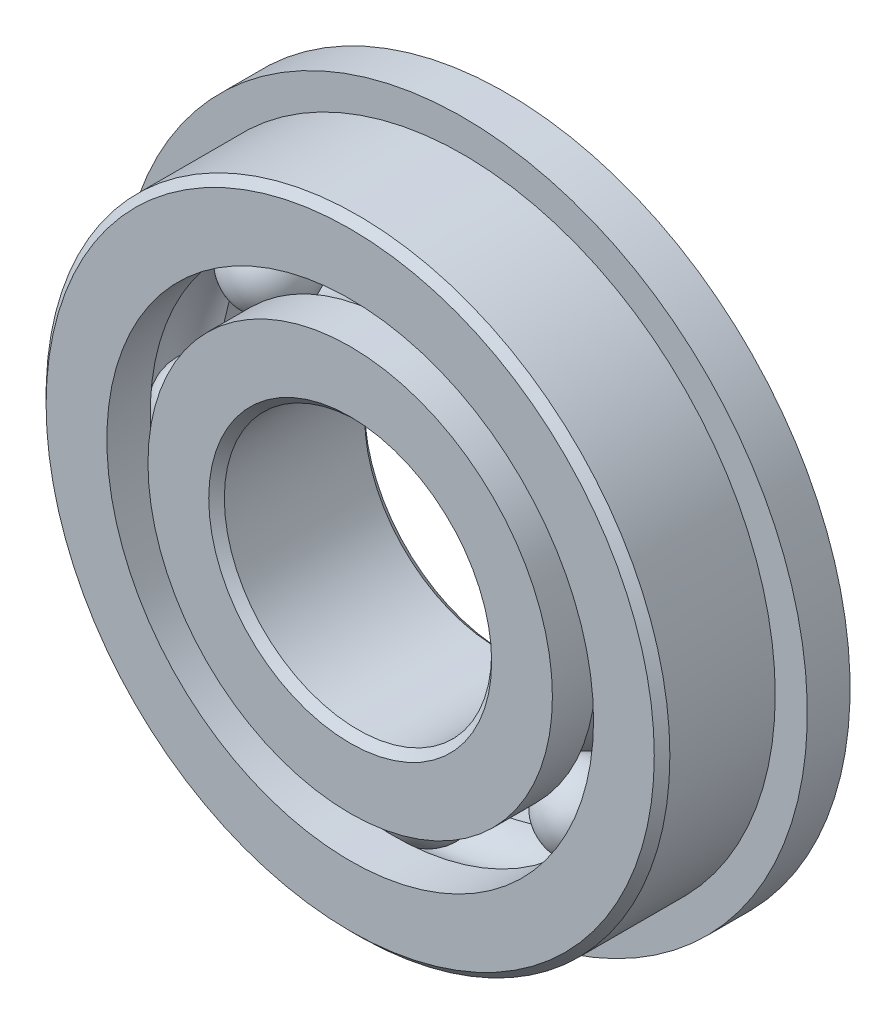
ISO-10303-21;
HEADER;
FILE_DESCRIPTION(('STEP AP214'),'2;1');
FILE_NAME('part.step','',(''),(''),'','','');
FILE_SCHEMA(('AUTOMOTIVE_DESIGN { 1 0 10303 214 1 1 1 1 }'));
ENDSEC;
DATA;
#1=APPLICATION_CONTEXT('core data for automotive mechanical design processes');
#2=APPLICATION_PROTOCOL_DEFINITION('international standard','automotive_design',2000,#1);
#3=PRODUCT_CONTEXT('',#1,'mechanical');
#4=PRODUCT('Part','Part','',(#3));
#5=PRODUCT_RELATED_PRODUCT_CATEGORY('part','',(#4));
#6=PRODUCT_DEFINITION_FORMATION('','',#4);
#7=PRODUCT_DEFINITION_CONTEXT('part definition',#1,'design');
#8=PRODUCT_DEFINITION('design','',#6,#7);
#9=PRODUCT_DEFINITION_SHAPE('','',#8);
#10=(LENGTH_UNIT() NAMED_UNIT(*) SI_UNIT(.MILLI.,.METRE.));
#11=(NAMED_UNIT(*) PLANE_ANGLE_UNIT() SI_UNIT($,.RADIAN.));
#12=(NAMED_UNIT(*) SI_UNIT($,.STERADIAN.) SOLID_ANGLE_UNIT());
#13=UNCERTAINTY_MEASURE_WITH_UNIT(LENGTH_MEASURE(1.E-05),#10,'distance_accuracy_value','');
#14=(GEOMETRIC_REPRESENTATION_CONTEXT(3) GLOBAL_UNCERTAINTY_ASSIGNED_CONTEXT((#13)) GLOBAL_UNIT_ASSIGNED_CONTEXT((#10,
#11,#12)) REPRESENTATION_CONTEXT('',''));
#15=CARTESIAN_POINT('',(0.,0.,0.));
#16=DIRECTION('',(0.,0.,1.));
#17=DIRECTION('',(1.,0.,0.));
#18=AXIS2_PLACEMENT_3D('',#15,#16,#17);
#19=CARTESIAN_POINT('',(-5.61266007566815,5.61266007566829,0.));
#20=DIRECTION('',(0.,0.,1.));
#21=DIRECTION('',(-0.707106781186539,0.707106781186556,0.));
#22=AXIS2_PLACEMENT_3D('',#19,#20,#21);
#23=SPHERICAL_SURFACE('',#22,1.43574962434293);
#24=CARTESIAN_POINT('',(-5.61266007566815,5.61266007566829,1.43574962434293));
#25=VERTEX_POINT('',#24);
#26=VERTEX_LOOP('',#25);
#27=FACE_BOUND('',#26,.T.);
#28=ADVANCED_FACE('F48',(#27),#23,.T.);
#29=CLOSED_SHELL('',(#28));
#30=MANIFOLD_SOLID_BREP('B2',#29);
#31=CARTESIAN_POINT('',(-7.9375,0.,0.));
#32=DIRECTION('',(0.,0.,1.));
#33=DIRECTION('',(-1.,0.,0.));
#34=AXIS2_PLACEMENT_3D('',#31,#32,#33);
#35=SPHERICAL_SURFACE('',#34,1.43574962434293);
#36=CARTESIAN_POINT('',(-7.9375,0.,1.43574962434293));
#37=VERTEX_POINT('',#36);
#38=VERTEX_LOOP('',#37);
#39=FACE_BOUND('',#38,.T.);
#40=ADVANCED_FACE('F69',(#39),#35,.T.);
#41=CLOSED_SHELL('',(#40));
#42=MANIFOLD_SOLID_BREP('B6',#41);
#43=CARTESIAN_POINT('',(-5.61266007566827,-5.61266007566817,0.));
#44=DIRECTION('',(0.,0.,1.));
#45=DIRECTION('',(-0.707106781186554,-0.707106781186541,0.));
#46=AXIS2_PLACEMENT_3D('',#43,#44,#45);
#47=SPHERICAL_SURFACE('',#46,1.43574962434293);
#48=CARTESIAN_POINT('',(-5.61266007566827,-5.61266007566817,1.43574962434293));
#49=VERTEX_POINT('',#48);
#50=VERTEX_LOOP('',#49);
#51=FACE_BOUND('',#50,.T.);
#52=ADVANCED_FACE('F90',(#51),#47,.T.);
#53=CLOSED_SHELL('',(#52));
#54=MANIFOLD_SOLID_BREP('B44',#53);
#55=CARTESIAN_POINT('',(0.,-7.9375,0.));
#56=DIRECTION('',(0.,0.,1.));
#57=DIRECTION('',(0.,-1.,0.));
#58=AXIS2_PLACEMENT_3D('',#55,#56,#57);
#59=SPHERICAL_SURFACE('',#58,1.43574962434293);
#60=CARTESIAN_POINT('',(0.,-7.9375,1.43574962434293));
#61=VERTEX_POINT('',#60);
#62=VERTEX_LOOP('',#61);
#63=FACE_BOUND('',#62,.T.);
#64=ADVANCED_FACE('F111',(#63),#59,.T.);
#65=CLOSED_SHELL('',(#64));
#66=MANIFOLD_SOLID_BREP('B65',#65);
#67=CARTESIAN_POINT('',(5.61266007566819,-5.61266007566825,0.));
#68=DIRECTION('',(0.,0.,1.));
#69=DIRECTION('',(0.707106781186544,-0.707106781186551,0.));
#70=AXIS2_PLACEMENT_3D('',#67,#68,#69);
#71=SPHERICAL_SURFACE('',#70,1.43574962434293);
#72=CARTESIAN_POINT('',(5.61266007566819,-5.61266007566825,1.43574962434293));
#73=VERTEX_POINT('',#72);
#74=VERTEX_LOOP('',#73);
#75=FACE_BOUND('',#74,.T.);
#76=ADVANCED_FACE('F132',(#75),#71,.T.);
#77=CLOSED_SHELL('',(#76));
#78=MANIFOLD_SOLID_BREP('B86',#77);
#79=CARTESIAN_POINT('',(7.9375,0.,0.));
#80=DIRECTION('',(0.,0.,1.));
#81=DIRECTION('',(1.,0.,0.));
#82=AXIS2_PLACEMENT_3D('',#79,#80,#81);
#83=SPHERICAL_SURFACE('',#82,1.43574962434293);
#84=CARTESIAN_POINT('',(7.9375,0.,1.43574962434293));
#85=VERTEX_POINT('',#84);
#86=VERTEX_LOOP('',#85);
#87=FACE_BOUND('',#86,.T.);
#88=ADVANCED_FACE('F153',(#87),#83,.T.);
#89=CLOSED_SHELL('',(#88));
#90=MANIFOLD_SOLID_BREP('B107',#89);
#91=CARTESIAN_POINT('',(5.61266007566823,5.61266007566821,0.));
#92=DIRECTION('',(0.,0.,1.));
#93=DIRECTION('',(0.707106781186549,0.707106781186546,0.));
#94=AXIS2_PLACEMENT_3D('',#91,#92,#93);
#95=SPHERICAL_SURFACE('',#94,1.43574962434293);
#96=CARTESIAN_POINT('',(5.61266007566823,5.61266007566821,1.43574962434293));
#97=VERTEX_POINT('',#96);
#98=VERTEX_LOOP('',#97);
#99=FACE_BOUND('',#98,.T.);
#100=ADVANCED_FACE('F174',(#99),#95,.T.);
#101=CLOSED_SHELL('',(#100));
#102=MANIFOLD_SOLID_BREP('B128',#101);
#103=CARTESIAN_POINT('',(0.,7.9375,0.));
#104=DIRECTION('',(0.,0.,1.));
#105=DIRECTION('',(0.,1.,0.));
#106=AXIS2_PLACEMENT_3D('',#103,#104,#105);
#107=SPHERICAL_SURFACE('',#106,1.43574962434293);
#108=CARTESIAN_POINT('',(0.,7.9375,1.43574962434293));
#109=VERTEX_POINT('',#108);
#110=VERTEX_LOOP('',#109);
#111=FACE_BOUND('',#110,.T.);
#112=ADVANCED_FACE('F197',(#111),#107,.T.);
#113=CLOSED_SHELL('',(#112));
#114=MANIFOLD_SOLID_BREP('B149',#113);
#115=CARTESIAN_POINT('',(0.,7.20480769230769,2.778125));
#116=DIRECTION('',(0.,0.,-1.));
#117=DIRECTION('',(-1.,0.,0.));
#118=AXIS2_PLACEMENT_3D('',#115,#116,#117);
#119=PLANE('',#118);
#120=CARTESIAN_POINT('',(0.,0.,2.778125));
#121=DIRECTION('',(0.,0.,1.));
#122=DIRECTION('',(1.,0.,0.));
#123=AXIS2_PLACEMENT_3D('',#120,#121,#122);
#124=CIRCLE('',#123,5.0403125);
#125=CARTESIAN_POINT('',(5.0403125,0.,2.778125));
#126=VERTEX_POINT('',#125);
#127=EDGE_CURVE('E254',#126,#126,#124,.T.);
#128=ORIENTED_EDGE('',*,*,#127,.F.);
#129=EDGE_LOOP('',(#128));
#130=FACE_BOUND('',#129,.T.);
#131=CARTESIAN_POINT('',(0.,0.,2.778125));
#132=DIRECTION('',(0.,0.,1.));
#133=DIRECTION('',(1.,0.,0.));
#134=AXIS2_PLACEMENT_3D('',#131,#132,#133);
#135=CIRCLE('',#134,7.20480769230769);
#136=CARTESIAN_POINT('',(7.20480769230769,0.,2.778125));
#137=VERTEX_POINT('',#136);
#138=EDGE_CURVE('E196',#137,#137,#135,.T.);
#139=ORIENTED_EDGE('',*,*,#138,.T.);
#140=EDGE_LOOP('',(#139));
#141=FACE_BOUND('',#140,.T.);
#142=ADVANCED_FACE('F217',(#130,#141),#119,.F.);
#143=CARTESIAN_POINT('',(0.,0.,2.778125));
#144=DIRECTION('',(0.,0.,1.));
#145=DIRECTION('',(1.,0.,0.));
#146=AXIS2_PLACEMENT_3D('',#143,#144,#145);
#147=CYLINDRICAL_SURFACE('',#146,7.20480769230769);
#148=ORIENTED_EDGE('',*,*,#138,.F.);
#149=EDGE_LOOP('',(#148));
#150=FACE_BOUND('',#149,.T.);
#151=CARTESIAN_POINT('',(0.,0.,1.23472222222222));
#152=DIRECTION('',(0.,0.,1.));
#153=DIRECTION('',(1.,0.,0.));
#154=AXIS2_PLACEMENT_3D('',#151,#152,#153);
#155=CIRCLE('',#154,7.20480769230769);
#156=CARTESIAN_POINT('',(7.20480769230769,0.,1.23472222222222));
#157=VERTEX_POINT('',#156);
#158=EDGE_CURVE('E224',#157,#157,#155,.T.);
#159=ORIENTED_EDGE('',*,*,#158,.T.);
#160=EDGE_LOOP('',(#159));
#161=FACE_BOUND('',#160,.T.);
#162=ADVANCED_FACE('F263',(#150,#161),#147,.T.);
#163=CARTESIAN_POINT('',(0.,0.,0.));
#164=DIRECTION('',(0.,0.,1.));
#165=DIRECTION('',(1.,0.,0.));
#166=AXIS2_PLACEMENT_3D('',#163,#164,#165);
#167=TOROIDAL_SURFACE('',#166,7.93749999999999,1.43574962434293);
#168=ORIENTED_EDGE('',*,*,#158,.F.);
#169=EDGE_LOOP('',(#168));
#170=FACE_BOUND('',#169,.T.);
#171=CARTESIAN_POINT('',(0.,0.,-1.23472222222222));
#172=DIRECTION('',(0.,0.,1.));
#173=DIRECTION('',(1.,0.,0.));
#174=AXIS2_PLACEMENT_3D('',#171,#172,#173);
#175=CIRCLE('',#174,7.20480769230769);
#176=CARTESIAN_POINT('',(7.20480769230769,0.,-1.23472222222222));
#177=VERTEX_POINT('',#176);
#178=EDGE_CURVE('E230',#177,#177,#175,.T.);
#179=ORIENTED_EDGE('',*,*,#178,.T.);
#180=EDGE_LOOP('',(#179));
#181=FACE_BOUND('',#180,.T.);
#182=ADVANCED_FACE('F267',(#170,#181),#167,.F.);
#183=CARTESIAN_POINT('',(0.,0.,2.778125));
#184=DIRECTION('',(0.,0.,1.));
#185=DIRECTION('',(1.,0.,0.));
#186=AXIS2_PLACEMENT_3D('',#183,#184,#185);
#187=CYLINDRICAL_SURFACE('',#186,7.20480769230769);
#188=ORIENTED_EDGE('',*,*,#178,.F.);
#189=EDGE_LOOP('',(#188));
#190=FACE_BOUND('',#189,.T.);
#191=CARTESIAN_POINT('',(0.,0.,-2.778125));
#192=DIRECTION('',(0.,0.,1.));
#193=DIRECTION('',(1.,0.,0.));
#194=AXIS2_PLACEMENT_3D('',#191,#192,#193);
#195=CIRCLE('',#194,7.20480769230769);
#196=CARTESIAN_POINT('',(7.20480769230769,0.,-2.778125));
#197=VERTEX_POINT('',#196);
#198=EDGE_CURVE('E236',#197,#197,#195,.T.);
#199=ORIENTED_EDGE('',*,*,#198,.T.);
#200=EDGE_LOOP('',(#199));
#201=FACE_BOUND('',#200,.T.);
#202=ADVANCED_FACE('F272',(#190,#201),#187,.T.);
#203=CARTESIAN_POINT('',(0.,5.0403125,-2.778125));
#204=DIRECTION('',(0.,0.,1.));
#205=DIRECTION('',(1.,0.,0.));
#206=AXIS2_PLACEMENT_3D('',#203,#204,#205);
#207=PLANE('',#206);
#208=ORIENTED_EDGE('',*,*,#198,.F.);
#209=EDGE_LOOP('',(#208));
#210=FACE_BOUND('',#209,.T.);
#211=CARTESIAN_POINT('',(0.,0.,-2.778125));
#212=DIRECTION('',(0.,0.,1.));
#213=DIRECTION('',(1.,0.,0.));
#214=AXIS2_PLACEMENT_3D('',#211,#212,#213);
#215=CIRCLE('',#214,5.0403125);
#216=CARTESIAN_POINT('',(5.0403125,0.,-2.778125));
#217=VERTEX_POINT('',#216);
#218=EDGE_CURVE('E242',#217,#217,#215,.T.);
#219=ORIENTED_EDGE('',*,*,#218,.T.);
#220=EDGE_LOOP('',(#219));
#221=FACE_BOUND('',#220,.T.);
#222=ADVANCED_FACE('F278',(#210,#221),#207,.F.);
#223=CARTESIAN_POINT('',(0.,0.,-2.5003125));
#224=DIRECTION('',(0.,0.,-1.));
#225=DIRECTION('',(-1.,0.,0.));
#226=AXIS2_PLACEMENT_3D('',#223,#224,#225);
#227=CONICAL_SURFACE('',#226,4.7625,0.785398163397442);
#228=ORIENTED_EDGE('',*,*,#218,.F.);
#229=EDGE_LOOP('',(#228));
#230=FACE_BOUND('',#229,.T.);
#231=CARTESIAN_POINT('',(0.,0.,-2.5003125));
#232=DIRECTION('',(0.,0.,1.));
#233=DIRECTION('',(1.,0.,0.));
#234=AXIS2_PLACEMENT_3D('',#231,#232,#233);
#235=CIRCLE('',#234,4.7625);
#236=CARTESIAN_POINT('',(4.7625,0.,-2.5003125));
#237=VERTEX_POINT('',#236);
#238=EDGE_CURVE('E246',#237,#237,#235,.T.);
#239=ORIENTED_EDGE('',*,*,#238,.T.);
#240=EDGE_LOOP('',(#239));
#241=FACE_BOUND('',#240,.T.);
#242=ADVANCED_FACE('F282',(#230,#241),#227,.F.);
#243=CARTESIAN_POINT('',(0.,0.,2.778125));
#244=DIRECTION('',(0.,0.,1.));
#245=DIRECTION('',(1.,0.,0.));
#246=AXIS2_PLACEMENT_3D('',#243,#244,#245);
#247=CYLINDRICAL_SURFACE('',#246,4.7625);
#248=ORIENTED_EDGE('',*,*,#238,.F.);
#249=EDGE_LOOP('',(#248));
#250=FACE_BOUND('',#249,.T.);
#251=CARTESIAN_POINT('',(0.,0.,2.5003125));
#252=DIRECTION('',(0.,0.,1.));
#253=DIRECTION('',(1.,0.,0.));
#254=AXIS2_PLACEMENT_3D('',#251,#252,#253);
#255=CIRCLE('',#254,4.7625);
#256=CARTESIAN_POINT('',(4.7625,0.,2.5003125));
#257=VERTEX_POINT('',#256);
#258=EDGE_CURVE('E250',#257,#257,#255,.T.);
#259=ORIENTED_EDGE('',*,*,#258,.T.);
#260=EDGE_LOOP('',(#259));
#261=FACE_BOUND('',#260,.T.);
#262=ADVANCED_FACE('F286',(#250,#261),#247,.F.);
#263=CARTESIAN_POINT('',(0.,0.,2.778125));
#264=DIRECTION('',(0.,0.,1.));
#265=DIRECTION('',(1.,0.,0.));
#266=AXIS2_PLACEMENT_3D('',#263,#264,#265);
#267=CONICAL_SURFACE('',#266,5.0403125,0.785398163397453);
#268=ORIENTED_EDGE('',*,*,#258,.F.);
#269=EDGE_LOOP('',(#268));
#270=FACE_BOUND('',#269,.T.);
#271=ORIENTED_EDGE('',*,*,#127,.T.);
#272=EDGE_LOOP('',(#271));
#273=FACE_BOUND('',#272,.T.);
#274=ADVANCED_FACE('F260',(#270,#273),#267,.F.);
#275=CLOSED_SHELL('',(#142,#162,#182,#202,#222,#242,#262,#274));
#276=MANIFOLD_SOLID_BREP('B170',#275);
#277=CARTESIAN_POINT('',(0.,0.,2.5003125));
#278=DIRECTION('',(0.,0.,-1.));
#279=DIRECTION('',(-1.,0.,0.));
#280=AXIS2_PLACEMENT_3D('',#277,#278,#279);
#281=CONICAL_SURFACE('',#280,11.1125,0.785398163397446);
#282=CARTESIAN_POINT('',(0.,0.,2.778125));
#283=DIRECTION('',(0.,0.,1.));
#284=DIRECTION('',(1.,0.,0.));
#285=AXIS2_PLACEMENT_3D('',#282,#283,#284);
#286=CIRCLE('',#285,10.8346875);
#287=CARTESIAN_POINT('',(10.8346875,0.,2.778125));
#288=VERTEX_POINT('',#287);
#289=EDGE_CURVE('E384',#288,#288,#286,.T.);
#290=ORIENTED_EDGE('',*,*,#289,.F.);
#291=EDGE_LOOP('',(#290));
#292=FACE_BOUND('',#291,.T.);
#293=CARTESIAN_POINT('',(0.,0.,2.5003125));
#294=DIRECTION('',(0.,0.,1.));
#295=DIRECTION('',(1.,0.,0.));
#296=AXIS2_PLACEMENT_3D('',#293,#294,#295);
#297=CIRCLE('',#296,11.1125);
#298=CARTESIAN_POINT('',(11.1125,0.,2.5003125));
#299=VERTEX_POINT('',#298);
#300=EDGE_CURVE('E216',#299,#299,#297,.T.);
#301=ORIENTED_EDGE('',*,*,#300,.T.);
#302=EDGE_LOOP('',(#301));
#303=FACE_BOUND('',#302,.T.);
#304=ADVANCED_FACE('F355',(#292,#303),#281,.T.);
#305=CARTESIAN_POINT('',(0.,0.,2.778125));
#306=DIRECTION('',(0.,0.,1.));
#307=DIRECTION('',(1.,0.,0.));
#308=AXIS2_PLACEMENT_3D('',#305,#306,#307);
#309=CYLINDRICAL_SURFACE('',#308,11.1125);
#310=CARTESIAN_POINT('',(0.,0.,-1.254125));
#311=DIRECTION('',(0.,0.,1.));
#312=DIRECTION('',(1.,0.,0.));
#313=AXIS2_PLACEMENT_3D('',#310,#311,#312);
#314=CIRCLE('',#313,11.1125);
#315=CARTESIAN_POINT('',(11.1125,0.,-1.254125));
#316=VERTEX_POINT('',#315);
#317=EDGE_CURVE('E388',#316,#316,#314,.T.);
#318=ORIENTED_EDGE('',*,*,#317,.T.);
#319=EDGE_LOOP('',(#318));
#320=FACE_BOUND('',#319,.T.);
#321=ORIENTED_EDGE('',*,*,#300,.F.);
#322=EDGE_LOOP('',(#321));
#323=FACE_BOUND('',#322,.T.);
#324=ADVANCED_FACE('F412',(#320,#323),#309,.T.);
#325=CARTESIAN_POINT('',(0.,10.8346875,-2.778125));
#326=DIRECTION('',(0.,0.,1.));
#327=DIRECTION('',(1.,0.,0.));
#328=AXIS2_PLACEMENT_3D('',#325,#326,#327);
#329=PLANE('',#328);
#330=CARTESIAN_POINT('',(0.,0.,-2.778125));
#331=DIRECTION('',(0.,0.,1.));
#332=DIRECTION('',(1.,0.,0.));
#333=AXIS2_PLACEMENT_3D('',#330,#331,#332);
#334=CIRCLE('',#333,8.67019230769231);
#335=CARTESIAN_POINT('',(8.67019230769231,0.,-2.778125));
#336=VERTEX_POINT('',#335);
#337=EDGE_CURVE('E362',#336,#336,#334,.T.);
#338=ORIENTED_EDGE('',*,*,#337,.T.);
#339=EDGE_LOOP('',(#338));
#340=FACE_BOUND('',#339,.T.);
#341=CARTESIAN_POINT('',(0.,0.,-2.778125));
#342=DIRECTION('',(0.,0.,-1.));
#343=DIRECTION('',(-1.,0.,0.));
#344=AXIS2_PLACEMENT_3D('',#341,#342,#343);
#345=CIRCLE('',#344,12.2555);
#346=CARTESIAN_POINT('',(-12.2555,0.,-2.778125));
#347=VERTEX_POINT('',#346);
#348=EDGE_CURVE('E392',#347,#347,#345,.T.);
#349=ORIENTED_EDGE('',*,*,#348,.T.);
#350=EDGE_LOOP('',(#349));
#351=FACE_BOUND('',#350,.T.);
#352=ADVANCED_FACE('F415',(#340,#351),#329,.F.);
#353=CARTESIAN_POINT('',(0.,0.,2.778125));
#354=DIRECTION('',(0.,0.,1.));
#355=DIRECTION('',(1.,0.,0.));
#356=AXIS2_PLACEMENT_3D('',#353,#354,#355);
#357=CYLINDRICAL_SURFACE('',#356,8.67019230769231);
#358=CARTESIAN_POINT('',(0.,0.,-1.23472222222222));
#359=DIRECTION('',(0.,0.,1.));
#360=DIRECTION('',(1.,0.,0.));
#361=AXIS2_PLACEMENT_3D('',#358,#359,#360);
#362=CIRCLE('',#361,8.67019230769231);
#363=CARTESIAN_POINT('',(8.67019230769231,0.,-1.23472222222222));
#364=VERTEX_POINT('',#363);
#365=EDGE_CURVE('E368',#364,#364,#362,.T.);
#366=ORIENTED_EDGE('',*,*,#365,.T.);
#367=EDGE_LOOP('',(#366));
#368=FACE_BOUND('',#367,.T.);
#369=ORIENTED_EDGE('',*,*,#337,.F.);
#370=EDGE_LOOP('',(#369));
#371=FACE_BOUND('',#370,.T.);
#372=ADVANCED_FACE('F420',(#368,#371),#357,.F.);
#373=CARTESIAN_POINT('',(0.,0.,0.));
#374=DIRECTION('',(0.,0.,1.));
#375=DIRECTION('',(1.,0.,0.));
#376=AXIS2_PLACEMENT_3D('',#373,#374,#375);
#377=TOROIDAL_SURFACE('',#376,7.9375,1.43574962434293);
#378=ORIENTED_EDGE('',*,*,#365,.F.);
#379=EDGE_LOOP('',(#378));
#380=FACE_BOUND('',#379,.T.);
#381=CARTESIAN_POINT('',(0.,0.,1.23472222222222));
#382=DIRECTION('',(0.,0.,1.));
#383=DIRECTION('',(1.,0.,0.));
#384=AXIS2_PLACEMENT_3D('',#381,#382,#383);
#385=CIRCLE('',#384,8.67019230769231);
#386=CARTESIAN_POINT('',(8.67019230769231,0.,1.23472222222222));
#387=VERTEX_POINT('',#386);
#388=EDGE_CURVE('E374',#387,#387,#385,.T.);
#389=ORIENTED_EDGE('',*,*,#388,.T.);
#390=EDGE_LOOP('',(#389));
#391=FACE_BOUND('',#390,.T.);
#392=ADVANCED_FACE('F426',(#380,#391),#377,.F.);
#393=CARTESIAN_POINT('',(0.,0.,2.778125));
#394=DIRECTION('',(0.,0.,1.));
#395=DIRECTION('',(1.,0.,0.));
#396=AXIS2_PLACEMENT_3D('',#393,#394,#395);
#397=CYLINDRICAL_SURFACE('',#396,8.67019230769231);
#398=ORIENTED_EDGE('',*,*,#388,.F.);
#399=EDGE_LOOP('',(#398));
#400=FACE_BOUND('',#399,.T.);
#401=CARTESIAN_POINT('',(0.,0.,2.778125));
#402=DIRECTION('',(0.,0.,1.));
#403=DIRECTION('',(1.,0.,0.));
#404=AXIS2_PLACEMENT_3D('',#401,#402,#403);
#405=CIRCLE('',#404,8.67019230769231);
#406=CARTESIAN_POINT('',(8.67019230769231,0.,2.778125));
#407=VERTEX_POINT('',#406);
#408=EDGE_CURVE('E380',#407,#407,#405,.T.);
#409=ORIENTED_EDGE('',*,*,#408,.T.);
#410=EDGE_LOOP('',(#409));
#411=FACE_BOUND('',#410,.T.);
#412=ADVANCED_FACE('F430',(#400,#411),#397,.F.);
#413=CARTESIAN_POINT('',(0.,10.8346875,2.778125));
#414=DIRECTION('',(0.,0.,-1.));
#415=DIRECTION('',(-1.,0.,0.));
#416=AXIS2_PLACEMENT_3D('',#413,#414,#415);
#417=PLANE('',#416);
#418=ORIENTED_EDGE('',*,*,#408,.F.);
#419=EDGE_LOOP('',(#418));
#420=FACE_BOUND('',#419,.T.);
#421=ORIENTED_EDGE('',*,*,#289,.T.);
#422=EDGE_LOOP('',(#421));
#423=FACE_BOUND('',#422,.T.);
#424=ADVANCED_FACE('F408',(#420,#423),#417,.F.);
#425=CARTESIAN_POINT('',(0.,8.67019230769231,-1.254125));
#426=DIRECTION('',(0.,0.,1.));
#427=DIRECTION('',(1.,0.,0.));
#428=AXIS2_PLACEMENT_3D('',#425,#426,#427);
#429=PLANE('',#428);
#430=CARTESIAN_POINT('',(0.,0.,-1.254125));
#431=DIRECTION('',(0.,0.,-1.));
#432=DIRECTION('',(-1.,0.,0.));
#433=AXIS2_PLACEMENT_3D('',#430,#431,#432);
#434=CIRCLE('',#433,12.2555);
#435=CARTESIAN_POINT('',(-12.2555,0.,-1.254125));
#436=VERTEX_POINT('',#435);
#437=EDGE_CURVE('E396',#436,#436,#434,.T.);
#438=ORIENTED_EDGE('',*,*,#437,.F.);
#439=EDGE_LOOP('',(#438));
#440=FACE_BOUND('',#439,.T.);
#441=ORIENTED_EDGE('',*,*,#317,.F.);
#442=EDGE_LOOP('',(#441));
#443=FACE_BOUND('',#442,.T.);
#444=ADVANCED_FACE('F405',(#440,#443),#429,.T.);
#445=CARTESIAN_POINT('',(0.,0.,-2.778125));
#446=DIRECTION('',(0.,0.,-1.));
#447=DIRECTION('',(-1.,0.,0.));
#448=AXIS2_PLACEMENT_3D('',#445,#446,#447);
#449=CYLINDRICAL_SURFACE('',#448,12.2555);
#450=ORIENTED_EDGE('',*,*,#437,.T.);
#451=EDGE_LOOP('',(#450));
#452=FACE_BOUND('',#451,.T.);
#453=ORIENTED_EDGE('',*,*,#348,.F.);
#454=EDGE_LOOP('',(#453));
#455=FACE_BOUND('',#454,.T.);
#456=ADVANCED_FACE('F402',(#452,#455),#449,.T.);
#457=CLOSED_SHELL('',(#304,#324,#352,#372,#392,#412,#424,#444,#456));
#458=MANIFOLD_SOLID_BREP('B191',#457);
#459=ADVANCED_BREP_SHAPE_REPRESENTATION('',(#18,#30,#42,#54,#66,#78,#90,#102,#114,#276,#458),#14);
#460=SHAPE_DEFINITION_REPRESENTATION(#9,#459);
ENDSEC;
END-ISO-10303-21;
